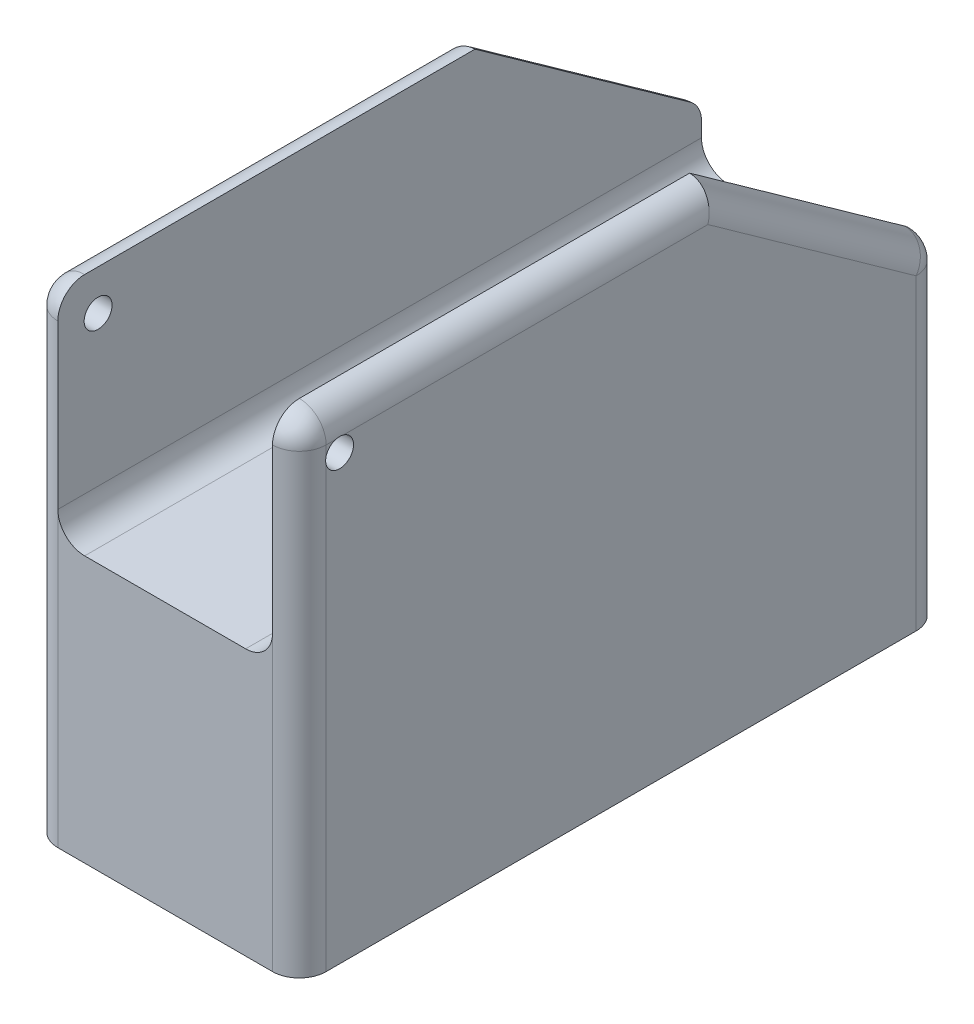
ISO-10303-21;
HEADER;
FILE_DESCRIPTION(('STEP AP214'),'2;1');
FILE_NAME('part.step','',(''),(''),'','','');
FILE_SCHEMA(('AUTOMOTIVE_DESIGN { 1 0 10303 214 1 1 1 1 }'));
ENDSEC;
DATA;
#1=APPLICATION_CONTEXT('core data for automotive mechanical design processes');
#2=APPLICATION_PROTOCOL_DEFINITION('international standard','automotive_design',2000,#1);
#3=PRODUCT_CONTEXT('',#1,'mechanical');
#4=PRODUCT('Part','Part','',(#3));
#5=PRODUCT_RELATED_PRODUCT_CATEGORY('part','',(#4));
#6=PRODUCT_DEFINITION_FORMATION('','',#4);
#7=PRODUCT_DEFINITION_CONTEXT('part definition',#1,'design');
#8=PRODUCT_DEFINITION('design','',#6,#7);
#9=PRODUCT_DEFINITION_SHAPE('','',#8);
#10=(LENGTH_UNIT() NAMED_UNIT(*) SI_UNIT(.MILLI.,.METRE.));
#11=(NAMED_UNIT(*) PLANE_ANGLE_UNIT() SI_UNIT($,.RADIAN.));
#12=(NAMED_UNIT(*) SI_UNIT($,.STERADIAN.) SOLID_ANGLE_UNIT());
#13=UNCERTAINTY_MEASURE_WITH_UNIT(LENGTH_MEASURE(1.E-05),#10,'distance_accuracy_value','');
#14=(GEOMETRIC_REPRESENTATION_CONTEXT(3) GLOBAL_UNCERTAINTY_ASSIGNED_CONTEXT((#13)) GLOBAL_UNIT_ASSIGNED_CONTEXT((#10,
#11,#12)) REPRESENTATION_CONTEXT('',''));
#15=CARTESIAN_POINT('',(0.,0.,0.));
#16=DIRECTION('',(0.,0.,1.));
#17=DIRECTION('',(1.,0.,0.));
#18=AXIS2_PLACEMENT_3D('',#15,#16,#17);
#19=CARTESIAN_POINT('',(63.5,0.,0.));
#20=DIRECTION('',(1.,0.,0.));
#21=DIRECTION('',(0.,0.,-1.));
#22=AXIS2_PLACEMENT_3D('',#19,#20,#21);
#23=PLANE('',#22);
#24=CARTESIAN_POINT('',(63.5,104.775,-9.525));
#25=DIRECTION('',(1.,0.,0.));
#26=DIRECTION('',(0.,0.,-1.));
#27=AXIS2_PLACEMENT_3D('',#24,#25,#26);
#28=CIRCLE('',#27,3.29999999999998);
#29=CARTESIAN_POINT('',(63.5,107.95,-8.6253472892277));
#30=VERTEX_POINT('',#29);
#31=CARTESIAN_POINT('',(63.5,105.674652710772,-6.35));
#32=VERTEX_POINT('',#31);
#33=EDGE_CURVE('E189',#30,#32,#28,.T.);
#34=ORIENTED_EDGE('',*,*,#33,.F.);
#35=DIRECTION('',(0.,0.,1.));
#36=VECTOR('',#35,1.);
#37=CARTESIAN_POINT('',(63.5,107.95,-6.35));
#38=LINE('',#37,#36);
#39=CARTESIAN_POINT('',(63.5,107.95,-6.35));
#40=VERTEX_POINT('',#39);
#41=EDGE_CURVE('E206',#30,#40,#38,.T.);
#42=ORIENTED_EDGE('',*,*,#41,.T.);
#43=DIRECTION('',(0.,-1.,0.));
#44=VECTOR('',#43,1.);
#45=CARTESIAN_POINT('',(63.5,0.,-6.35));
#46=LINE('',#45,#44);
#47=EDGE_CURVE('E343',#40,#32,#46,.T.);
#48=ORIENTED_EDGE('',*,*,#47,.T.);
#49=EDGE_LOOP('',(#34,#42,#48));
#50=FACE_BOUND('',#49,.T.);
#51=ADVANCED_FACE('F36',(#50),#23,.T.);
#52=CARTESIAN_POINT('',(0.,0.,0.));
#53=DIRECTION('',(1.,0.,0.));
#54=DIRECTION('',(0.,0.,-1.));
#55=AXIS2_PLACEMENT_3D('',#52,#53,#54);
#56=PLANE('',#55);
#57=DIRECTION('',(0.,0.,1.));
#58=VECTOR('',#57,1.);
#59=CARTESIAN_POINT('',(0.,107.95,0.));
#60=LINE('',#59,#58);
#61=CARTESIAN_POINT('',(0.,107.95,-6.35));
#62=VERTEX_POINT('',#61);
#63=CARTESIAN_POINT('',(0.,107.95,-8.6253472892277));
#64=VERTEX_POINT('',#63);
#65=EDGE_CURVE('E196',#62,#64,#60,.F.);
#66=ORIENTED_EDGE('',*,*,#65,.T.);
#67=CARTESIAN_POINT('',(0.,104.775,-9.525));
#68=DIRECTION('',(1.,0.,0.));
#69=DIRECTION('',(0.,0.,-1.));
#70=AXIS2_PLACEMENT_3D('',#67,#68,#69);
#71=CIRCLE('',#70,3.3);
#72=CARTESIAN_POINT('',(0.,105.674652710772,-6.34999999999999));
#73=VERTEX_POINT('',#72);
#74=EDGE_CURVE('E174',#64,#73,#71,.T.);
#75=ORIENTED_EDGE('',*,*,#74,.T.);
#76=DIRECTION('',(0.,-1.,0.));
#77=VECTOR('',#76,1.);
#78=CARTESIAN_POINT('',(0.,0.,-6.35));
#79=LINE('',#78,#77);
#80=EDGE_CURVE('E405',#73,#62,#79,.F.);
#81=ORIENTED_EDGE('',*,*,#80,.T.);
#82=EDGE_LOOP('',(#66,#75,#81));
#83=FACE_BOUND('',#82,.T.);
#84=ADVANCED_FACE('F304',(#83),#56,.F.);
#85=CARTESIAN_POINT('',(63.5,114.3,0.));
#86=DIRECTION('',(0.,0.,-1.));
#87=DIRECTION('',(0.,1.,0.));
#88=AXIS2_PLACEMENT_3D('',#85,#86,#87);
#89=PLANE('',#88);
#90=DIRECTION('',(0.,-1.,0.));
#91=VECTOR('',#90,1.);
#92=CARTESIAN_POINT('',(57.15,114.3,0.));
#93=LINE('',#92,#91);
#94=CARTESIAN_POINT('',(57.15,0.,0.));
#95=VERTEX_POINT('',#94);
#96=CARTESIAN_POINT('',(57.15,69.3337366507502,0.));
#97=VERTEX_POINT('',#96);
#98=EDGE_CURVE('E392',#95,#97,#93,.F.);
#99=ORIENTED_EDGE('',*,*,#98,.T.);
#100=CARTESIAN_POINT('',(50.8,69.3337366507502,0.));
#101=DIRECTION('',(0.,0.,-1.));
#102=DIRECTION('',(0.,1.,0.));
#103=AXIS2_PLACEMENT_3D('',#100,#101,#102);
#104=CIRCLE('',#103,6.35);
#105=CARTESIAN_POINT('',(50.8,62.9837366507502,0.));
#106=VERTEX_POINT('',#105);
#107=EDGE_CURVE('E432',#97,#106,#104,.T.);
#108=ORIENTED_EDGE('',*,*,#107,.T.);
#109=DIRECTION('',(1.,0.,0.));
#110=VECTOR('',#109,1.);
#111=CARTESIAN_POINT('',(6.35,62.9837366507502,0.));
#112=LINE('',#111,#110);
#113=CARTESIAN_POINT('',(12.7,62.9837366507502,0.));
#114=VERTEX_POINT('',#113);
#115=EDGE_CURVE('E221',#114,#106,#112,.T.);
#116=ORIENTED_EDGE('',*,*,#115,.F.);
#117=CARTESIAN_POINT('',(12.7,69.3337366507502,0.));
#118=DIRECTION('',(0.,0.,-1.));
#119=DIRECTION('',(0.,1.,0.));
#120=AXIS2_PLACEMENT_3D('',#117,#118,#119);
#121=CIRCLE('',#120,6.35);
#122=CARTESIAN_POINT('',(6.35,69.3337366507502,0.));
#123=VERTEX_POINT('',#122);
#124=EDGE_CURVE('E45',#114,#123,#121,.T.);
#125=ORIENTED_EDGE('',*,*,#124,.T.);
#126=DIRECTION('',(0.,-1.,0.));
#127=VECTOR('',#126,1.);
#128=CARTESIAN_POINT('',(6.35,114.3,0.));
#129=LINE('',#128,#127);
#130=CARTESIAN_POINT('',(6.35,0.,0.));
#131=VERTEX_POINT('',#130);
#132=EDGE_CURVE('E52',#123,#131,#129,.T.);
#133=ORIENTED_EDGE('',*,*,#132,.T.);
#134=DIRECTION('',(-1.,0.,0.));
#135=VECTOR('',#134,1.);
#136=CARTESIAN_POINT('',(63.5,0.,0.));
#137=LINE('',#136,#135);
#138=EDGE_CURVE('E382',#95,#131,#137,.T.);
#139=ORIENTED_EDGE('',*,*,#138,.F.);
#140=EDGE_LOOP('',(#99,#108,#116,#125,#133,#139));
#141=FACE_BOUND('',#140,.T.);
#142=ADVANCED_FACE('F311',(#141),#89,.F.);
#143=CARTESIAN_POINT('',(63.5,0.,0.));
#144=DIRECTION('',(0.,1.,0.));
#145=DIRECTION('',(0.,0.,1.));
#146=AXIS2_PLACEMENT_3D('',#143,#144,#145);
#147=PLANE('',#146);
#148=ORIENTED_EDGE('',*,*,#138,.T.);
#149=CARTESIAN_POINT('',(6.35,0.,-6.35));
#150=DIRECTION('',(0.,1.,0.));
#151=DIRECTION('',(0.,0.,1.));
#152=AXIS2_PLACEMENT_3D('',#149,#150,#151);
#153=CIRCLE('',#152,6.35);
#154=CARTESIAN_POINT('',(0.,0.,-6.35));
#155=VERTEX_POINT('',#154);
#156=EDGE_CURVE('E401',#131,#155,#153,.F.);
#157=ORIENTED_EDGE('',*,*,#156,.T.);
#158=DIRECTION('',(0.,0.,-1.));
#159=VECTOR('',#158,1.);
#160=CARTESIAN_POINT('',(0.,0.,0.));
#161=LINE('',#160,#159);
#162=CARTESIAN_POINT('',(0.,0.,-145.972485170748));
#163=VERTEX_POINT('',#162);
#164=EDGE_CURVE('E379',#155,#163,#161,.T.);
#165=ORIENTED_EDGE('',*,*,#164,.T.);
#166=CARTESIAN_POINT('',(6.35,0.,-145.972485170748));
#167=DIRECTION('',(0.,1.,0.));
#168=DIRECTION('',(0.,0.,1.));
#169=AXIS2_PLACEMENT_3D('',#166,#167,#168);
#170=CIRCLE('',#169,6.35);
#171=CARTESIAN_POINT('',(6.35,0.,-152.322485170748));
#172=VERTEX_POINT('',#171);
#173=EDGE_CURVE('E399',#163,#172,#170,.F.);
#174=ORIENTED_EDGE('',*,*,#173,.T.);
#175=DIRECTION('',(-1.,0.,0.));
#176=VECTOR('',#175,1.);
#177=CARTESIAN_POINT('',(63.5,0.,-152.322485170748));
#178=LINE('',#177,#176);
#179=CARTESIAN_POINT('',(57.15,0.,-152.322485170748));
#180=VERTEX_POINT('',#179);
#181=EDGE_CURVE('E378',#180,#172,#178,.T.);
#182=ORIENTED_EDGE('',*,*,#181,.F.);
#183=CARTESIAN_POINT('',(57.15,0.,-145.972485170748));
#184=DIRECTION('',(0.,1.,0.));
#185=DIRECTION('',(0.,0.,1.));
#186=AXIS2_PLACEMENT_3D('',#183,#184,#185);
#187=CIRCLE('',#186,6.35);
#188=CARTESIAN_POINT('',(63.5,0.,-145.972485170748));
#189=VERTEX_POINT('',#188);
#190=EDGE_CURVE('E397',#180,#189,#187,.F.);
#191=ORIENTED_EDGE('',*,*,#190,.T.);
#192=DIRECTION('',(0.,0.,-1.));
#193=VECTOR('',#192,1.);
#194=CARTESIAN_POINT('',(63.5,0.,0.));
#195=LINE('',#194,#193);
#196=CARTESIAN_POINT('',(63.5,0.,-6.35));
#197=VERTEX_POINT('',#196);
#198=EDGE_CURVE('E376',#197,#189,#195,.T.);
#199=ORIENTED_EDGE('',*,*,#198,.F.);
#200=CARTESIAN_POINT('',(57.15,0.,-6.35));
#201=DIRECTION('',(0.,1.,0.));
#202=DIRECTION('',(0.,0.,1.));
#203=AXIS2_PLACEMENT_3D('',#200,#201,#202);
#204=CIRCLE('',#203,6.35);
#205=EDGE_CURVE('E341',#197,#95,#204,.F.);
#206=ORIENTED_EDGE('',*,*,#205,.T.);
#207=EDGE_LOOP('',(#148,#157,#165,#174,#182,#191,#199,#206));
#208=FACE_BOUND('',#207,.T.);
#209=ADVANCED_FACE('F324',(#208),#147,.F.);
#210=CARTESIAN_POINT('',(63.5,0.,-152.322485170748));
#211=DIRECTION('',(0.,0.,1.));
#212=DIRECTION('',(0.,-1.,0.));
#213=AXIS2_PLACEMENT_3D('',#210,#211,#212);
#214=PLANE('',#213);
#215=DIRECTION('',(0.,1.,0.));
#216=VECTOR('',#215,1.);
#217=CARTESIAN_POINT('',(6.35,0.,-152.322485170748));
#218=LINE('',#217,#216);
#219=CARTESIAN_POINT('',(6.35,69.3337366507502,-152.322485170748));
#220=VERTEX_POINT('',#219);
#221=EDGE_CURVE('E344',#172,#220,#218,.T.);
#222=ORIENTED_EDGE('',*,*,#221,.T.);
#223=CARTESIAN_POINT('',(12.7,69.3337366507502,-152.322485170748));
#224=DIRECTION('',(0.,0.,1.));
#225=DIRECTION('',(0.,-1.,0.));
#226=AXIS2_PLACEMENT_3D('',#223,#224,#225);
#227=CIRCLE('',#226,6.35);
#228=CARTESIAN_POINT('',(12.7,62.9837366507502,-152.322485170748));
#229=VERTEX_POINT('',#228);
#230=EDGE_CURVE('E11',#220,#229,#227,.T.);
#231=ORIENTED_EDGE('',*,*,#230,.T.);
#232=DIRECTION('',(1.,0.,0.));
#233=VECTOR('',#232,1.);
#234=CARTESIAN_POINT('',(6.35,62.9837366507502,-152.322485170748));
#235=LINE('',#234,#233);
#236=CARTESIAN_POINT('',(50.8,62.9837366507502,-152.322485170748));
#237=VERTEX_POINT('',#236);
#238=EDGE_CURVE('E447',#229,#237,#235,.T.);
#239=ORIENTED_EDGE('',*,*,#238,.T.);
#240=CARTESIAN_POINT('',(50.8,69.3337366507502,-152.322485170748));
#241=DIRECTION('',(0.,0.,1.));
#242=DIRECTION('',(0.,-1.,0.));
#243=AXIS2_PLACEMENT_3D('',#240,#241,#242);
#244=CIRCLE('',#243,6.35);
#245=CARTESIAN_POINT('',(57.15,69.3337366507502,-152.322485170748));
#246=VERTEX_POINT('',#245);
#247=EDGE_CURVE('E414',#237,#246,#244,.T.);
#248=ORIENTED_EDGE('',*,*,#247,.T.);
#249=DIRECTION('',(0.,1.,0.));
#250=VECTOR('',#249,1.);
#251=CARTESIAN_POINT('',(57.15,0.,-152.322485170748));
#252=LINE('',#251,#250);
#253=EDGE_CURVE('E406',#246,#180,#252,.F.);
#254=ORIENTED_EDGE('',*,*,#253,.T.);
#255=ORIENTED_EDGE('',*,*,#181,.T.);
#256=EDGE_LOOP('',(#222,#231,#239,#248,#254,#255));
#257=FACE_BOUND('',#256,.T.);
#258=ADVANCED_FACE('F317',(#257),#214,.F.);
#259=CARTESIAN_POINT('',(63.5,103.875347289228,-6.35));
#260=VERTEX_POINT('',#259);
#261=CARTESIAN_POINT('',(63.5,107.95,-10.4246527107723));
#262=VERTEX_POINT('',#261);
#263=EDGE_CURVE('E328',#260,#262,#28,.T.);
#264=ORIENTED_EDGE('',*,*,#263,.F.);
#265=EDGE_CURVE('E331',#260,#197,#46,.T.);
#266=ORIENTED_EDGE('',*,*,#265,.T.);
#267=ORIENTED_EDGE('',*,*,#198,.T.);
#268=DIRECTION('',(0.,1.,0.));
#269=VECTOR('',#268,1.);
#270=CARTESIAN_POINT('',(63.5,76.0585351986307,-145.972485170748));
#271=LINE('',#270,#269);
#272=CARTESIAN_POINT('',(63.5,72.7879164633338,-145.972485170748));
#273=VERTEX_POINT('',#272);
#274=EDGE_CURVE('E346',#189,#273,#271,.T.);
#275=ORIENTED_EDGE('',*,*,#274,.T.);
#276=DIRECTION('',(0.,0.580671780695957,0.814137754377837));
#277=VECTOR('',#276,1.);
#278=CARTESIAN_POINT('',(63.5,109.130225259701,-95.0183202603782));
#279=LINE('',#278,#277);
#280=CARTESIAN_POINT('',(63.5,107.95,-96.673069078103));
#281=VERTEX_POINT('',#280);
#282=EDGE_CURVE('E210',#273,#281,#279,.T.);
#283=ORIENTED_EDGE('',*,*,#282,.T.);
#284=EDGE_CURVE('E207',#281,#262,#38,.T.);
#285=ORIENTED_EDGE('',*,*,#284,.T.);
#286=EDGE_LOOP('',(#264,#266,#267,#275,#283,#285));
#287=FACE_BOUND('',#286,.T.);
#288=ADVANCED_FACE('F307',(#287),#23,.T.);
#289=CARTESIAN_POINT('',(0.,103.875347289228,-6.34999999999999));
#290=VERTEX_POINT('',#289);
#291=EDGE_CURVE('E188',#155,#290,#79,.F.);
#292=ORIENTED_EDGE('',*,*,#291,.T.);
#293=CARTESIAN_POINT('',(0.,107.95,-10.4246527107723));
#294=VERTEX_POINT('',#293);
#295=EDGE_CURVE('E171',#290,#294,#71,.T.);
#296=ORIENTED_EDGE('',*,*,#295,.T.);
#297=CARTESIAN_POINT('',(0.,107.95,-96.673069078103));
#298=VERTEX_POINT('',#297);
#299=EDGE_CURVE('E184',#294,#298,#60,.F.);
#300=ORIENTED_EDGE('',*,*,#299,.T.);
#301=DIRECTION('',(0.,0.580671780695957,0.814137754377837));
#302=VECTOR('',#301,1.);
#303=CARTESIAN_POINT('',(0.,117.253335505405,-83.6292172354729));
#304=LINE('',#303,#302);
#305=CARTESIAN_POINT('',(0.,72.7879164633338,-145.972485170748));
#306=VERTEX_POINT('',#305);
#307=EDGE_CURVE('E199',#298,#306,#304,.F.);
#308=ORIENTED_EDGE('',*,*,#307,.T.);
#309=DIRECTION('',(0.,1.,0.));
#310=VECTOR('',#309,1.);
#311=CARTESIAN_POINT('',(0.,0.,-145.972485170748));
#312=LINE('',#311,#310);
#313=EDGE_CURVE('E403',#306,#163,#312,.F.);
#314=ORIENTED_EDGE('',*,*,#313,.T.);
#315=ORIENTED_EDGE('',*,*,#164,.F.);
#316=EDGE_LOOP('',(#292,#296,#300,#308,#314,#315));
#317=FACE_BOUND('',#316,.T.);
#318=ADVANCED_FACE('F183',(#317),#56,.F.);
#319=CARTESIAN_POINT('',(6.35,114.3,-6.35));
#320=DIRECTION('',(0.,-1.,0.));
#321=DIRECTION('',(0.,0.,-1.));
#322=AXIS2_PLACEMENT_3D('',#319,#320,#321);
#323=CYLINDRICAL_SURFACE('',#322,6.35);
#324=CARTESIAN_POINT('',(0.,103.875347289228,-6.35));
#325=CARTESIAN_POINT('',(1.48100153282552E-05,103.965624983153,-6.32440870727141));
#326=CARTESIAN_POINT('',(0.000155280942107094,104.056997923296,-6.30268783361807));
#327=CARTESIAN_POINT('',(0.000512296823301424,104.241280477158,-6.2670966583893));
#328=CARTESIAN_POINT('',(0.000728857961616775,104.334190413777,-6.2532280285758));
#329=CARTESIAN_POINT('',(0.00105886586162596,104.518737457397,-6.23368620212672));
#330=CARTESIAN_POINT('',(0.00117453978028913,104.610355643517,-6.22783427348453));
#331=CARTESIAN_POINT('',(0.00125466754471502,104.793725134528,-6.22377898585513));
#332=CARTESIAN_POINT('',(0.00121917176591426,104.885476384888,-6.22557307892567));
#333=CARTESIAN_POINT('',(0.000974022636119318,105.094076451928,-6.23837108862324));
#334=CARTESIAN_POINT('',(0.000718529905622238,105.210783375742,-6.25180555381175));
#335=CARTESIAN_POINT('',(0.000250946284424215,105.4438263423,-6.29128719527435));
#336=CARTESIAN_POINT('',(3.95553883863134E-05,105.560131205988,-6.31751850059687));
#337=CARTESIAN_POINT('',(0.,105.674652710772,-6.35));
#338=B_SPLINE_CURVE_WITH_KNOTS('',3,(#324,#325,#326,#327,#328,#329,#330,#331,#332,#333,#334,
#335,#336,#337),.UNSPECIFIED.,.F.,.F.,(4,2,2,2,2,2,4),(0.,0.281416997868663,0.562893887597173,
0.837987128436087,1.11298870502087,1.46473789252302,1.82170459091711),.UNSPECIFIED.);
#339=EDGE_CURVE('E262',#290,#73,#338,.T.);
#340=ORIENTED_EDGE('',*,*,#339,.F.);
#341=ORIENTED_EDGE('',*,*,#291,.F.);
#342=ORIENTED_EDGE('',*,*,#156,.F.);
#343=ORIENTED_EDGE('',*,*,#132,.F.);
#344=CARTESIAN_POINT('',(6.35,107.95,0.));
#345=VERTEX_POINT('',#344);
#346=EDGE_CURVE('E394',#345,#123,#129,.T.);
#347=ORIENTED_EDGE('',*,*,#346,.F.);
#348=CARTESIAN_POINT('',(6.35,107.95,-6.35));
#349=DIRECTION('',(0.,-1.,0.));
#350=DIRECTION('',(0.,0.,-1.));
#351=AXIS2_PLACEMENT_3D('',#348,#349,#350);
#352=CIRCLE('',#351,6.35);
#353=EDGE_CURVE('E361',#345,#62,#352,.T.);
#354=ORIENTED_EDGE('',*,*,#353,.T.);
#355=ORIENTED_EDGE('',*,*,#80,.F.);
#356=EDGE_LOOP('',(#340,#341,#342,#343,#347,#354,#355));
#357=FACE_BOUND('',#356,.T.);
#358=ADVANCED_FACE('F323',(#357),#323,.T.);
#359=CARTESIAN_POINT('',(6.35,0.,-145.972485170748));
#360=DIRECTION('',(0.,1.,0.));
#361=DIRECTION('',(0.,0.,1.));
#362=AXIS2_PLACEMENT_3D('',#359,#360,#361);
#363=CYLINDRICAL_SURFACE('',#362,6.35);
#364=ORIENTED_EDGE('',*,*,#313,.F.);
#365=CARTESIAN_POINT('',(6.35,72.7879164633338,-145.972485170748));
#366=DIRECTION('',(0.,1.,0.));
#367=DIRECTION('',(0.,0.,1.));
#368=AXIS2_PLACEMENT_3D('',#365,#366,#367);
#369=CIRCLE('',#368,6.35);
#370=CARTESIAN_POINT('',(6.35,72.7879164633338,-152.322485170748));
#371=VERTEX_POINT('',#370);
#372=EDGE_CURVE('E354',#306,#371,#369,.F.);
#373=ORIENTED_EDGE('',*,*,#372,.T.);
#374=DIRECTION('',(0.,-1.,0.));
#375=VECTOR('',#374,1.);
#376=CARTESIAN_POINT('',(6.35,62.9837366507502,-152.322485170748));
#377=LINE('',#376,#375);
#378=EDGE_CURVE('E423',#371,#220,#377,.T.);
#379=ORIENTED_EDGE('',*,*,#378,.T.);
#380=ORIENTED_EDGE('',*,*,#221,.F.);
#381=ORIENTED_EDGE('',*,*,#173,.F.);
#382=EDGE_LOOP('',(#364,#373,#379,#380,#381));
#383=FACE_BOUND('',#382,.T.);
#384=ADVANCED_FACE('F419',(#383),#363,.T.);
#385=CARTESIAN_POINT('',(57.15,0.,-145.972485170748));
#386=DIRECTION('',(0.,-1.,0.));
#387=DIRECTION('',(0.,0.,-1.));
#388=AXIS2_PLACEMENT_3D('',#385,#386,#387);
#389=CYLINDRICAL_SURFACE('',#388,6.35);
#390=CARTESIAN_POINT('',(57.15,72.7879164633338,-152.322485170748));
#391=VERTEX_POINT('',#390);
#392=EDGE_CURVE('E348',#391,#246,#252,.F.);
#393=ORIENTED_EDGE('',*,*,#392,.F.);
#394=CARTESIAN_POINT('',(57.15,72.7879164633338,-145.972485170748));
#395=DIRECTION('',(0.,-1.,0.));
#396=DIRECTION('',(0.,0.,-1.));
#397=AXIS2_PLACEMENT_3D('',#394,#395,#396);
#398=CIRCLE('',#397,6.35);
#399=EDGE_CURVE('E201',#391,#273,#398,.T.);
#400=ORIENTED_EDGE('',*,*,#399,.T.);
#401=ORIENTED_EDGE('',*,*,#274,.F.);
#402=ORIENTED_EDGE('',*,*,#190,.F.);
#403=ORIENTED_EDGE('',*,*,#253,.F.);
#404=EDGE_LOOP('',(#393,#400,#401,#402,#403));
#405=FACE_BOUND('',#404,.T.);
#406=ADVANCED_FACE('F274',(#405),#389,.T.);
#407=CARTESIAN_POINT('',(57.15,0.,-6.35));
#408=DIRECTION('',(0.,1.,0.));
#409=DIRECTION('',(0.,0.,1.));
#410=AXIS2_PLACEMENT_3D('',#407,#408,#409);
#411=CYLINDRICAL_SURFACE('',#410,6.35);
#412=CARTESIAN_POINT('',(63.5,105.674652710772,-6.35));
#413=CARTESIAN_POINT('',(63.4999851899847,105.584375016847,-6.32440870727141));
#414=CARTESIAN_POINT('',(63.4998447190579,105.493002076704,-6.30268783361807));
#415=CARTESIAN_POINT('',(63.4994877031767,105.308719522842,-6.2670966583893));
#416=CARTESIAN_POINT('',(63.4992711420384,105.215809586223,-6.2532280285758));
#417=CARTESIAN_POINT('',(63.4989411341384,105.031262542603,-6.23368620212672));
#418=CARTESIAN_POINT('',(63.4988254602197,104.939644356483,-6.22783427348453));
#419=CARTESIAN_POINT('',(63.4987453324553,104.756274865472,-6.22377898585513));
#420=CARTESIAN_POINT('',(63.4987808282341,104.664523615112,-6.22557307892567));
#421=CARTESIAN_POINT('',(63.4990259773639,104.455923548072,-6.23837108862324));
#422=CARTESIAN_POINT('',(63.4992814700944,104.339216624258,-6.25180555381175));
#423=CARTESIAN_POINT('',(63.4997490537156,104.1061736577,-6.29128719527435));
#424=CARTESIAN_POINT('',(63.4999604446116,103.989868794012,-6.31751850059687));
#425=CARTESIAN_POINT('',(63.5,103.875347289228,-6.35));
#426=B_SPLINE_CURVE_WITH_KNOTS('',3,(#412,#413,#414,#415,#416,#417,#418,#419,#420,#421,#422,
#423,#424,#425),.UNSPECIFIED.,.F.,.F.,(4,2,2,2,2,2,4),(0.,0.281416997868663,0.562893887597187,
0.837987128436087,1.11298870502087,1.46473789252302,1.82170459091711),.UNSPECIFIED.);
#427=EDGE_CURVE('E179',#32,#260,#426,.T.);
#428=ORIENTED_EDGE('',*,*,#427,.F.);
#429=ORIENTED_EDGE('',*,*,#47,.F.);
#430=CARTESIAN_POINT('',(57.15,107.95,-6.35));
#431=DIRECTION('',(0.,1.,0.));
#432=DIRECTION('',(0.,0.,1.));
#433=AXIS2_PLACEMENT_3D('',#430,#431,#432);
#434=CIRCLE('',#433,6.35);
#435=CARTESIAN_POINT('',(57.15,107.95,0.));
#436=VERTEX_POINT('',#435);
#437=EDGE_CURVE('E197',#40,#436,#434,.F.);
#438=ORIENTED_EDGE('',*,*,#437,.T.);
#439=DIRECTION('',(0.,1.,0.));
#440=VECTOR('',#439,1.);
#441=CARTESIAN_POINT('',(57.15,62.9837366507502,0.));
#442=LINE('',#441,#440);
#443=EDGE_CURVE('E449',#97,#436,#442,.T.);
#444=ORIENTED_EDGE('',*,*,#443,.F.);
#445=ORIENTED_EDGE('',*,*,#98,.F.);
#446=ORIENTED_EDGE('',*,*,#205,.F.);
#447=ORIENTED_EDGE('',*,*,#265,.F.);
#448=EDGE_LOOP('',(#428,#429,#438,#444,#445,#446,#447));
#449=FACE_BOUND('',#448,.T.);
#450=ADVANCED_FACE('F268',(#449),#411,.T.);
#451=CARTESIAN_POINT('',(6.35,62.9837366507502,-152.322485170748));
#452=DIRECTION('',(-1.,0.,0.));
#453=DIRECTION('',(0.,0.,1.));
#454=AXIS2_PLACEMENT_3D('',#451,#452,#453);
#455=PLANE('',#454);
#456=CARTESIAN_POINT('',(6.35,104.775,-9.525));
#457=DIRECTION('',(-1.,0.,0.));
#458=DIRECTION('',(0.,0.,1.));
#459=AXIS2_PLACEMENT_3D('',#456,#457,#458);
#460=CIRCLE('',#459,3.29999999999999);
#461=CARTESIAN_POINT('',(6.35,104.775,-6.22500000000001));
#462=VERTEX_POINT('',#461);
#463=EDGE_CURVE('E225',#462,#462,#460,.T.);
#464=ORIENTED_EDGE('',*,*,#463,.T.);
#465=EDGE_LOOP('',(#464));
#466=FACE_BOUND('',#465,.T.);
#467=ORIENTED_EDGE('',*,*,#346,.T.);
#468=DIRECTION('',(0.,0.,1.));
#469=VECTOR('',#468,1.);
#470=CARTESIAN_POINT('',(6.35,69.3337366507502,-152.322485170748));
#471=LINE('',#470,#469);
#472=EDGE_CURVE('E429',#123,#220,#471,.F.);
#473=ORIENTED_EDGE('',*,*,#472,.T.);
#474=ORIENTED_EDGE('',*,*,#378,.F.);
#475=CARTESIAN_POINT('',(6.35,72.7879164633338,-145.972485170748));
#476=DIRECTION('',(-1.,0.,0.));
#477=DIRECTION('',(0.,0.,1.));
#478=AXIS2_PLACEMENT_3D('',#475,#476,#477);
#479=CIRCLE('',#478,6.35);
#480=CARTESIAN_POINT('',(6.35,77.9576912036331,-149.659750978168));
#481=VERTEX_POINT('',#480);
#482=EDGE_CURVE('E359',#371,#481,#479,.F.);
#483=ORIENTED_EDGE('',*,*,#482,.T.);
#484=DIRECTION('',(0.,-0.580671780695957,-0.814137754377837));
#485=VECTOR('',#484,1.);
#486=CARTESIAN_POINT('',(6.35,76.0585351986307,-152.322485170748));
#487=LINE('',#486,#485);
#488=CARTESIAN_POINT('',(6.35,114.3,-98.7055860677976));
#489=VERTEX_POINT('',#488);
#490=EDGE_CURVE('E385',#489,#481,#487,.T.);
#491=ORIENTED_EDGE('',*,*,#490,.F.);
#492=DIRECTION('',(0.,0.,1.));
#493=VECTOR('',#492,1.);
#494=CARTESIAN_POINT('',(6.35,114.3,-152.322485170748));
#495=LINE('',#494,#493);
#496=CARTESIAN_POINT('',(6.35,114.3,-6.34999999999999));
#497=VERTEX_POINT('',#496);
#498=EDGE_CURVE('E459',#489,#497,#495,.T.);
#499=ORIENTED_EDGE('',*,*,#498,.T.);
#500=CARTESIAN_POINT('',(6.35,107.95,-6.35));
#501=DIRECTION('',(-1.,0.,0.));
#502=DIRECTION('',(0.,0.,1.));
#503=AXIS2_PLACEMENT_3D('',#500,#501,#502);
#504=CIRCLE('',#503,6.35);
#505=EDGE_CURVE('E357',#497,#345,#504,.F.);
#506=ORIENTED_EDGE('',*,*,#505,.T.);
#507=EDGE_LOOP('',(#467,#473,#474,#483,#491,#499,#506));
#508=FACE_BOUND('',#507,.T.);
#509=ADVANCED_FACE('F273',(#466,#508),#455,.F.);
#510=CARTESIAN_POINT('',(57.15,62.9837366507502,-152.322485170748));
#511=DIRECTION('',(1.,0.,0.));
#512=DIRECTION('',(0.,0.,-1.));
#513=AXIS2_PLACEMENT_3D('',#510,#511,#512);
#514=PLANE('',#513);
#515=CARTESIAN_POINT('',(57.15,104.775,-9.525));
#516=DIRECTION('',(1.,0.,0.));
#517=DIRECTION('',(0.,0.,-1.));
#518=AXIS2_PLACEMENT_3D('',#515,#516,#517);
#519=CIRCLE('',#518,3.29999999999999);
#520=CARTESIAN_POINT('',(57.15,104.775,-12.825));
#521=VERTEX_POINT('',#520);
#522=EDGE_CURVE('E472',#521,#521,#519,.T.);
#523=ORIENTED_EDGE('',*,*,#522,.T.);
#524=EDGE_LOOP('',(#523));
#525=FACE_BOUND('',#524,.T.);
#526=ORIENTED_EDGE('',*,*,#392,.T.);
#527=DIRECTION('',(0.,0.,1.));
#528=VECTOR('',#527,1.);
#529=CARTESIAN_POINT('',(57.15,69.3337366507502,0.));
#530=LINE('',#529,#528);
#531=EDGE_CURVE('E236',#246,#97,#530,.T.);
#532=ORIENTED_EDGE('',*,*,#531,.T.);
#533=ORIENTED_EDGE('',*,*,#443,.T.);
#534=CARTESIAN_POINT('',(57.15,107.95,-6.35));
#535=DIRECTION('',(1.,0.,0.));
#536=DIRECTION('',(0.,0.,-1.));
#537=AXIS2_PLACEMENT_3D('',#534,#535,#536);
#538=CIRCLE('',#537,6.35);
#539=CARTESIAN_POINT('',(57.15,114.3,-6.34999999999999));
#540=VERTEX_POINT('',#539);
#541=EDGE_CURVE('E364',#436,#540,#538,.F.);
#542=ORIENTED_EDGE('',*,*,#541,.T.);
#543=DIRECTION('',(0.,0.,1.));
#544=VECTOR('',#543,1.);
#545=CARTESIAN_POINT('',(57.15,114.3,-152.322485170748));
#546=LINE('',#545,#544);
#547=CARTESIAN_POINT('',(57.15,114.3,-98.7055860677976));
#548=VERTEX_POINT('',#547);
#549=EDGE_CURVE('E462',#548,#540,#546,.T.);
#550=ORIENTED_EDGE('',*,*,#549,.F.);
#551=DIRECTION('',(0.,0.580671780695957,0.814137754377837));
#552=VECTOR('',#551,1.);
#553=CARTESIAN_POINT('',(57.15,76.0585351986307,-152.322485170748));
#554=LINE('',#553,#552);
#555=CARTESIAN_POINT('',(57.15,77.9576912036331,-149.659750978168));
#556=VERTEX_POINT('',#555);
#557=EDGE_CURVE('E461',#556,#548,#554,.T.);
#558=ORIENTED_EDGE('',*,*,#557,.F.);
#559=CARTESIAN_POINT('',(57.15,72.7879164633338,-145.972485170748));
#560=DIRECTION('',(1.,0.,0.));
#561=DIRECTION('',(0.,0.,-1.));
#562=AXIS2_PLACEMENT_3D('',#559,#560,#561);
#563=CIRCLE('',#562,6.35);
#564=EDGE_CURVE('E366',#556,#391,#563,.F.);
#565=ORIENTED_EDGE('',*,*,#564,.T.);
#566=EDGE_LOOP('',(#526,#532,#533,#542,#550,#558,#565));
#567=FACE_BOUND('',#566,.T.);
#568=ADVANCED_FACE('F247',(#525,#567),#514,.F.);
#569=CARTESIAN_POINT('',(6.35,62.9837366507502,-152.322485170748));
#570=DIRECTION('',(0.,-1.,0.));
#571=DIRECTION('',(0.,0.,-1.));
#572=AXIS2_PLACEMENT_3D('',#569,#570,#571);
#573=PLANE('',#572);
#574=ORIENTED_EDGE('',*,*,#115,.T.);
#575=DIRECTION('',(0.,0.,1.));
#576=VECTOR('',#575,1.);
#577=CARTESIAN_POINT('',(50.8,62.9837366507502,-152.322485170748));
#578=LINE('',#577,#576);
#579=EDGE_CURVE('E433',#106,#237,#578,.F.);
#580=ORIENTED_EDGE('',*,*,#579,.T.);
#581=ORIENTED_EDGE('',*,*,#238,.F.);
#582=DIRECTION('',(0.,0.,1.));
#583=VECTOR('',#582,1.);
#584=CARTESIAN_POINT('',(12.7,62.9837366507502,0.));
#585=LINE('',#584,#583);
#586=EDGE_CURVE('E436',#229,#114,#585,.T.);
#587=ORIENTED_EDGE('',*,*,#586,.T.);
#588=EDGE_LOOP('',(#574,#580,#581,#587));
#589=FACE_BOUND('',#588,.T.);
#590=ADVANCED_FACE('F291',(#589),#573,.F.);
#591=CARTESIAN_POINT('',(6.35,107.95,-6.35));
#592=DIRECTION('',(0.,0.,1.));
#593=DIRECTION('',(1.,0.,0.));
#594=AXIS2_PLACEMENT_3D('',#591,#592,#593);
#595=SPHERICAL_SURFACE('',#594,6.35);
#596=ORIENTED_EDGE('',*,*,#353,.F.);
#597=ORIENTED_EDGE('',*,*,#505,.F.);
#598=CARTESIAN_POINT('',(6.35,107.95,-6.35));
#599=DIRECTION('',(0.,0.,-1.));
#600=DIRECTION('',(0.,1.,0.));
#601=AXIS2_PLACEMENT_3D('',#598,#599,#600);
#602=CIRCLE('',#601,6.35);
#603=EDGE_CURVE('E218',#62,#497,#602,.T.);
#604=ORIENTED_EDGE('',*,*,#603,.F.);
#605=EDGE_LOOP('',(#596,#597,#604));
#606=FACE_BOUND('',#605,.T.);
#607=ADVANCED_FACE('F288',(#606),#595,.T.);
#608=CARTESIAN_POINT('',(6.35,107.95,-98.7055860677976));
#609=DIRECTION('',(0.,0.,1.));
#610=DIRECTION('',(0.,-1.,0.));
#611=AXIS2_PLACEMENT_3D('',#608,#609,#610);
#612=CYLINDRICAL_SURFACE('',#611,6.35);
#613=CARTESIAN_POINT('',(0.,107.95,-8.6253472892277));
#614=CARTESIAN_POINT('',(1.4810015327922E-05,107.975591292729,-8.71562498315326));
#615=CARTESIAN_POINT('',(0.000155280942106666,107.997312166382,-8.80699792329598));
#616=CARTESIAN_POINT('',(0.000512296823301095,108.032903341611,-8.99128047715784));
#617=CARTESIAN_POINT('',(0.000728857961616644,108.046771971424,-9.08419041377705));
#618=CARTESIAN_POINT('',(0.00105886586162627,108.066313797873,-9.26873745739657));
#619=CARTESIAN_POINT('',(0.00117453978028969,108.072165726515,-9.36035564351735));
#620=CARTESIAN_POINT('',(0.00125466754471589,108.076221014145,-9.54372513452779));
#621=CARTESIAN_POINT('',(0.0012191717659152,108.074426921074,-9.63547638488839));
#622=CARTESIAN_POINT('',(0.000974022636119974,108.061628911377,-9.84407645192821));
#623=CARTESIAN_POINT('',(0.000718529905622426,108.048194446188,-9.96078337574221));
#624=CARTESIAN_POINT('',(0.00025094628442379,108.008712804726,-10.1938263422999));
#625=CARTESIAN_POINT('',(3.95553883857439E-05,107.982481499403,-10.3101312059881));
#626=CARTESIAN_POINT('',(0.,107.95,-10.4246527107723));
#627=B_SPLINE_CURVE_WITH_KNOTS('',3,(#613,#614,#615,#616,#617,#618,#619,#620,#621,#622,#623,
#624,#625,#626),.UNSPECIFIED.,.F.,.F.,(4,2,2,2,2,2,4),(0.,0.281416997868649,0.562893887597162,
0.837987128436065,1.11298870502087,1.46473789252305,1.82170459091715),.UNSPECIFIED.);
#628=EDGE_CURVE('E167',#64,#294,#627,.T.);
#629=ORIENTED_EDGE('',*,*,#628,.F.);
#630=ORIENTED_EDGE('',*,*,#65,.F.);
#631=ORIENTED_EDGE('',*,*,#603,.T.);
#632=ORIENTED_EDGE('',*,*,#498,.F.);
#633=CARTESIAN_POINT('',(6.35,107.95,-96.673069078103));
#634=DIRECTION('',(0.,0.304846064122668,0.952401636490046));
#635=DIRECTION('',(0.,-0.952401636490046,0.304846064122668));
#636=AXIS2_PLACEMENT_3D('',#633,#634,#635);
#637=ELLIPSE('',#636,6.66735519628264,6.35);
#638=EDGE_CURVE('E194',#298,#489,#637,.F.);
#639=ORIENTED_EDGE('',*,*,#638,.F.);
#640=ORIENTED_EDGE('',*,*,#299,.F.);
#641=EDGE_LOOP('',(#629,#630,#631,#632,#639,#640));
#642=FACE_BOUND('',#641,.T.);
#643=ADVANCED_FACE('F191',(#642),#612,.T.);
#644=CARTESIAN_POINT('',(6.35,70.8887604583314,-148.635219363329));
#645=DIRECTION('',(0.,0.580671780695957,0.814137754377837));
#646=DIRECTION('',(0.,-0.814137754377837,0.580671780695957));
#647=AXIS2_PLACEMENT_3D('',#644,#645,#646);
#648=CYLINDRICAL_SURFACE('',#647,6.35);
#649=ORIENTED_EDGE('',*,*,#638,.T.);
#650=ORIENTED_EDGE('',*,*,#490,.T.);
#651=CARTESIAN_POINT('',(6.35,72.7879164633338,-145.972485170748));
#652=DIRECTION('',(0.,-0.580671780695957,-0.814137754377837));
#653=DIRECTION('',(0.,0.814137754377837,-0.580671780695957));
#654=AXIS2_PLACEMENT_3D('',#651,#652,#653);
#655=CIRCLE('',#654,6.35);
#656=EDGE_CURVE('E213',#306,#481,#655,.T.);
#657=ORIENTED_EDGE('',*,*,#656,.F.);
#658=ORIENTED_EDGE('',*,*,#307,.F.);
#659=EDGE_LOOP('',(#649,#650,#657,#658));
#660=FACE_BOUND('',#659,.T.);
#661=ADVANCED_FACE('F281',(#660),#648,.T.);
#662=CARTESIAN_POINT('',(6.35,72.7879164633338,-145.972485170748));
#663=DIRECTION('',(0.,0.,1.));
#664=DIRECTION('',(1.,0.,0.));
#665=AXIS2_PLACEMENT_3D('',#662,#663,#664);
#666=SPHERICAL_SURFACE('',#665,6.35);
#667=ORIENTED_EDGE('',*,*,#482,.F.);
#668=ORIENTED_EDGE('',*,*,#372,.F.);
#669=ORIENTED_EDGE('',*,*,#656,.T.);
#670=EDGE_LOOP('',(#667,#668,#669));
#671=FACE_BOUND('',#670,.T.);
#672=ADVANCED_FACE('F277',(#671),#666,.T.);
#673=CARTESIAN_POINT('',(57.15,107.95,-6.35));
#674=DIRECTION('',(0.,0.,1.));
#675=DIRECTION('',(1.,0.,0.));
#676=AXIS2_PLACEMENT_3D('',#673,#674,#675);
#677=SPHERICAL_SURFACE('',#676,6.35);
#678=ORIENTED_EDGE('',*,*,#541,.F.);
#679=ORIENTED_EDGE('',*,*,#437,.F.);
#680=CARTESIAN_POINT('',(57.15,107.95,-6.35));
#681=DIRECTION('',(0.,0.,-1.));
#682=DIRECTION('',(0.,1.,0.));
#683=AXIS2_PLACEMENT_3D('',#680,#681,#682);
#684=CIRCLE('',#683,6.35);
#685=EDGE_CURVE('E216',#540,#40,#684,.T.);
#686=ORIENTED_EDGE('',*,*,#685,.F.);
#687=EDGE_LOOP('',(#678,#679,#686));
#688=FACE_BOUND('',#687,.T.);
#689=ADVANCED_FACE('F280',(#688),#677,.T.);
#690=CARTESIAN_POINT('',(57.15,107.95,0.));
#691=DIRECTION('',(0.,0.,-1.));
#692=DIRECTION('',(0.,1.,0.));
#693=AXIS2_PLACEMENT_3D('',#690,#691,#692);
#694=CYLINDRICAL_SURFACE('',#693,6.35);
#695=CARTESIAN_POINT('',(63.5,107.95,-10.4246527107723));
#696=CARTESIAN_POINT('',(63.4999851899847,107.975591292729,-10.3343750168468));
#697=CARTESIAN_POINT('',(63.4998447190579,107.997312166382,-10.243002076704));
#698=CARTESIAN_POINT('',(63.4994877031767,108.032903341611,-10.0587195228422));
#699=CARTESIAN_POINT('',(63.4992711420384,108.046771971424,-9.96580958622296));
#700=CARTESIAN_POINT('',(63.4989411341384,108.066313797873,-9.78126254260343));
#701=CARTESIAN_POINT('',(63.4988254602197,108.072165726515,-9.68964435648266));
#702=CARTESIAN_POINT('',(63.4987453324553,108.076221014145,-9.50627486547221));
#703=CARTESIAN_POINT('',(63.4987808282341,108.074426921074,-9.41452361511162));
#704=CARTESIAN_POINT('',(63.4990259773639,108.061628911377,-9.20592354807179));
#705=CARTESIAN_POINT('',(63.4992814700944,108.048194446188,-9.0892166242578));
#706=CARTESIAN_POINT('',(63.4997490537156,108.008712804726,-8.8561736577001));
#707=CARTESIAN_POINT('',(63.4999604446116,107.982481499403,-8.73986879401189));
#708=CARTESIAN_POINT('',(63.5,107.95,-8.6253472892277));
#709=B_SPLINE_CURVE_WITH_KNOTS('',3,(#695,#696,#697,#698,#699,#700,#701,#702,#703,#704,#705,
#706,#707,#708),.UNSPECIFIED.,.F.,.F.,(4,2,2,2,2,2,4),(0.,0.281416997868649,0.562893887597162,
0.837987128436065,1.11298870502087,1.46473789252305,1.82170459091715),.UNSPECIFIED.);
#710=EDGE_CURVE('E212',#262,#30,#709,.T.);
#711=ORIENTED_EDGE('',*,*,#710,.F.);
#712=ORIENTED_EDGE('',*,*,#284,.F.);
#713=CARTESIAN_POINT('',(57.15,107.95,-96.673069078103));
#714=DIRECTION('',(0.,-0.304846064122668,-0.952401636490046));
#715=DIRECTION('',(0.,0.952401636490046,-0.304846064122668));
#716=AXIS2_PLACEMENT_3D('',#713,#714,#715);
#717=ELLIPSE('',#716,6.66735519628264,6.35);
#718=EDGE_CURVE('E224',#548,#281,#717,.T.);
#719=ORIENTED_EDGE('',*,*,#718,.F.);
#720=ORIENTED_EDGE('',*,*,#549,.T.);
#721=ORIENTED_EDGE('',*,*,#685,.T.);
#722=ORIENTED_EDGE('',*,*,#41,.F.);
#723=EDGE_LOOP('',(#711,#712,#719,#720,#721,#722));
#724=FACE_BOUND('',#723,.T.);
#725=ADVANCED_FACE('F238',(#724),#694,.T.);
#726=CARTESIAN_POINT('',(57.15,117.253335505405,-83.6292172354729));
#727=DIRECTION('',(0.,-0.580671780695957,-0.814137754377837));
#728=DIRECTION('',(0.,0.814137754377837,-0.580671780695957));
#729=AXIS2_PLACEMENT_3D('',#726,#727,#728);
#730=CYLINDRICAL_SURFACE('',#729,6.35);
#731=ORIENTED_EDGE('',*,*,#718,.T.);
#732=ORIENTED_EDGE('',*,*,#282,.F.);
#733=CARTESIAN_POINT('',(57.15,72.7879164633338,-145.972485170748));
#734=DIRECTION('',(0.,-0.580671780695956,-0.814137754377837));
#735=DIRECTION('',(0.,0.814137754377837,-0.580671780695956));
#736=AXIS2_PLACEMENT_3D('',#733,#734,#735);
#737=CIRCLE('',#736,6.35);
#738=EDGE_CURVE('E222',#556,#273,#737,.T.);
#739=ORIENTED_EDGE('',*,*,#738,.F.);
#740=ORIENTED_EDGE('',*,*,#557,.T.);
#741=EDGE_LOOP('',(#731,#732,#739,#740));
#742=FACE_BOUND('',#741,.T.);
#743=ADVANCED_FACE('F295',(#742),#730,.T.);
#744=CARTESIAN_POINT('',(57.15,72.7879164633338,-145.972485170748));
#745=DIRECTION('',(0.,0.,1.));
#746=DIRECTION('',(1.,0.,0.));
#747=AXIS2_PLACEMENT_3D('',#744,#745,#746);
#748=SPHERICAL_SURFACE('',#747,6.35);
#749=ORIENTED_EDGE('',*,*,#738,.T.);
#750=ORIENTED_EDGE('',*,*,#399,.F.);
#751=ORIENTED_EDGE('',*,*,#564,.F.);
#752=EDGE_LOOP('',(#749,#750,#751));
#753=FACE_BOUND('',#752,.T.);
#754=ADVANCED_FACE('F293',(#753),#748,.T.);
#755=CARTESIAN_POINT('',(63.5,104.775,-9.525));
#756=DIRECTION('',(1.,0.,0.));
#757=DIRECTION('',(0.,0.,-1.));
#758=AXIS2_PLACEMENT_3D('',#755,#756,#757);
#759=CYLINDRICAL_SURFACE('',#758,3.29999999999999);
#760=ORIENTED_EDGE('',*,*,#427,.T.);
#761=ORIENTED_EDGE('',*,*,#263,.T.);
#762=ORIENTED_EDGE('',*,*,#710,.T.);
#763=ORIENTED_EDGE('',*,*,#33,.T.);
#764=EDGE_LOOP('',(#760,#761,#762,#763));
#765=FACE_BOUND('',#764,.T.);
#766=ORIENTED_EDGE('',*,*,#522,.F.);
#767=EDGE_LOOP('',(#766));
#768=FACE_BOUND('',#767,.T.);
#769=ADVANCED_FACE('F246',(#765,#768),#759,.F.);
#770=ORIENTED_EDGE('',*,*,#339,.T.);
#771=ORIENTED_EDGE('',*,*,#74,.F.);
#772=ORIENTED_EDGE('',*,*,#628,.T.);
#773=ORIENTED_EDGE('',*,*,#295,.F.);
#774=EDGE_LOOP('',(#770,#771,#772,#773));
#775=FACE_BOUND('',#774,.T.);
#776=ORIENTED_EDGE('',*,*,#463,.F.);
#777=EDGE_LOOP('',(#776));
#778=FACE_BOUND('',#777,.T.);
#779=ADVANCED_FACE('F169',(#775,#778),#759,.F.);
#780=CARTESIAN_POINT('',(50.8,69.3337366507502,-152.322485170748));
#781=DIRECTION('',(0.,0.,-1.));
#782=DIRECTION('',(-1.,0.,0.));
#783=AXIS2_PLACEMENT_3D('',#780,#781,#782);
#784=CYLINDRICAL_SURFACE('',#783,6.35);
#785=ORIENTED_EDGE('',*,*,#247,.F.);
#786=ORIENTED_EDGE('',*,*,#579,.F.);
#787=ORIENTED_EDGE('',*,*,#107,.F.);
#788=ORIENTED_EDGE('',*,*,#531,.F.);
#789=EDGE_LOOP('',(#785,#786,#787,#788));
#790=FACE_BOUND('',#789,.T.);
#791=ADVANCED_FACE('F245',(#790),#784,.F.);
#792=CARTESIAN_POINT('',(12.7,69.3337366507502,-152.322485170748));
#793=DIRECTION('',(0.,0.,-1.));
#794=DIRECTION('',(-1.,0.,0.));
#795=AXIS2_PLACEMENT_3D('',#792,#793,#794);
#796=CYLINDRICAL_SURFACE('',#795,6.35);
#797=ORIENTED_EDGE('',*,*,#230,.F.);
#798=ORIENTED_EDGE('',*,*,#472,.F.);
#799=ORIENTED_EDGE('',*,*,#124,.F.);
#800=ORIENTED_EDGE('',*,*,#586,.F.);
#801=EDGE_LOOP('',(#797,#798,#799,#800));
#802=FACE_BOUND('',#801,.T.);
#803=ADVANCED_FACE('F38',(#802),#796,.F.);
#804=CLOSED_SHELL('',(#51,#84,#142,#209,#258,#288,#318,#358,#384,#406,#450,#509,#568,#590,#607,
#643,#661,#672,#689,#725,#743,#754,#769,#779,#791,#803));
#805=MANIFOLD_SOLID_BREP('B2',#804);
#806=ADVANCED_BREP_SHAPE_REPRESENTATION('',(#18,#805),#14);
#807=SHAPE_DEFINITION_REPRESENTATION(#9,#806);
ENDSEC;
END-ISO-10303-21;
